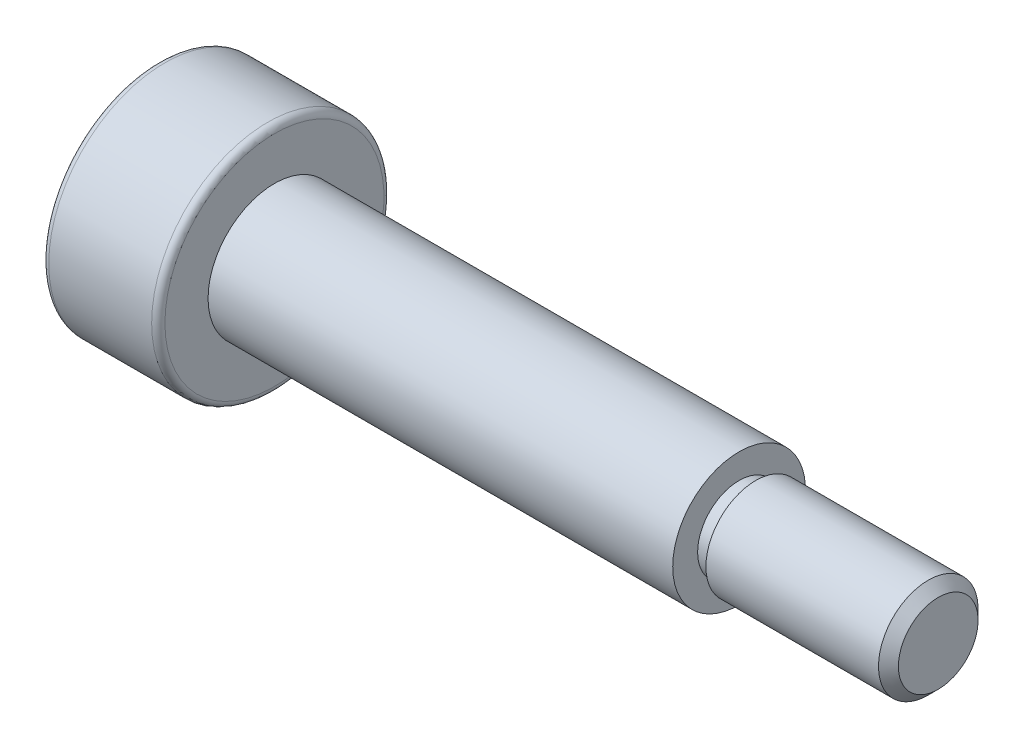
ISO-10303-21;
HEADER;
FILE_DESCRIPTION(('STEP AP214'),'2;1');
FILE_NAME('part.step','',(''),(''),'','','');
FILE_SCHEMA(('AUTOMOTIVE_DESIGN { 1 0 10303 214 1 1 1 1 }'));
ENDSEC;
DATA;
#1=APPLICATION_CONTEXT('core data for automotive mechanical design processes');
#2=APPLICATION_PROTOCOL_DEFINITION('international standard','automotive_design',2000,#1);
#3=PRODUCT_CONTEXT('',#1,'mechanical');
#4=PRODUCT('Part','Part','',(#3));
#5=PRODUCT_RELATED_PRODUCT_CATEGORY('part','',(#4));
#6=PRODUCT_DEFINITION_FORMATION('','',#4);
#7=PRODUCT_DEFINITION_CONTEXT('part definition',#1,'design');
#8=PRODUCT_DEFINITION('design','',#6,#7);
#9=PRODUCT_DEFINITION_SHAPE('','',#8);
#10=(LENGTH_UNIT() NAMED_UNIT(*) SI_UNIT(.MILLI.,.METRE.));
#11=(NAMED_UNIT(*) PLANE_ANGLE_UNIT() SI_UNIT($,.RADIAN.));
#12=(NAMED_UNIT(*) SI_UNIT($,.STERADIAN.) SOLID_ANGLE_UNIT());
#13=UNCERTAINTY_MEASURE_WITH_UNIT(LENGTH_MEASURE(1.E-05),#10,'distance_accuracy_value','');
#14=(GEOMETRIC_REPRESENTATION_CONTEXT(3) GLOBAL_UNCERTAINTY_ASSIGNED_CONTEXT((#13)) GLOBAL_UNIT_ASSIGNED_CONTEXT((#10,
#11,#12)) REPRESENTATION_CONTEXT('',''));
#15=CARTESIAN_POINT('',(0.,0.,0.));
#16=DIRECTION('',(0.,0.,1.));
#17=DIRECTION('',(1.,0.,0.));
#18=AXIS2_PLACEMENT_3D('',#15,#16,#17);
#19=CARTESIAN_POINT('',(-11.75,0.,0.));
#20=DIRECTION('',(1.,0.,0.));
#21=DIRECTION('',(0.,0.,-1.));
#22=AXIS2_PLACEMENT_3D('',#19,#20,#21);
#23=PLANE('',#22);
#24=DIRECTION('',(0.,0.866025403784438,-0.5));
#25=VECTOR('',#24,1.);
#26=CARTESIAN_POINT('',(-11.75,0.,1.73205080756888));
#27=LINE('',#26,#25);
#28=CARTESIAN_POINT('',(-11.75,0.,1.73205080756888));
#29=VERTEX_POINT('',#28);
#30=CARTESIAN_POINT('',(-11.75,1.5,0.866025403784438));
#31=VERTEX_POINT('',#30);
#32=EDGE_CURVE('E125',#29,#31,#27,.T.);
#33=ORIENTED_EDGE('',*,*,#32,.F.);
#34=DIRECTION('',(0.,0.866025403784439,0.5));
#35=VECTOR('',#34,1.);
#36=CARTESIAN_POINT('',(-11.75,-1.5,0.866025403784438));
#37=LINE('',#36,#35);
#38=CARTESIAN_POINT('',(-11.75,-1.5,0.866025403784438));
#39=VERTEX_POINT('',#38);
#40=EDGE_CURVE('E51',#39,#29,#37,.T.);
#41=ORIENTED_EDGE('',*,*,#40,.F.);
#42=DIRECTION('',(0.,0.,1.));
#43=VECTOR('',#42,1.);
#44=CARTESIAN_POINT('',(-11.75,-1.5,-0.866025403784438));
#45=LINE('',#44,#43);
#46=CARTESIAN_POINT('',(-11.75,-1.5,-0.866025403784438));
#47=VERTEX_POINT('',#46);
#48=EDGE_CURVE('E134',#47,#39,#45,.T.);
#49=ORIENTED_EDGE('',*,*,#48,.F.);
#50=DIRECTION('',(0.,-0.866025403784438,0.5));
#51=VECTOR('',#50,1.);
#52=CARTESIAN_POINT('',(-11.75,0.,-1.73205080756888));
#53=LINE('',#52,#51);
#54=CARTESIAN_POINT('',(-11.75,0.,-1.73205080756888));
#55=VERTEX_POINT('',#54);
#56=EDGE_CURVE('E132',#55,#47,#53,.T.);
#57=ORIENTED_EDGE('',*,*,#56,.F.);
#58=DIRECTION('',(0.,-0.866025403784439,-0.5));
#59=VECTOR('',#58,1.);
#60=CARTESIAN_POINT('',(-11.75,1.5,-0.866025403784438));
#61=LINE('',#60,#59);
#62=CARTESIAN_POINT('',(-11.75,1.5,-0.866025403784438));
#63=VERTEX_POINT('',#62);
#64=EDGE_CURVE('E99',#63,#55,#61,.T.);
#65=ORIENTED_EDGE('',*,*,#64,.F.);
#66=DIRECTION('',(0.,0.,-1.));
#67=VECTOR('',#66,1.);
#68=CARTESIAN_POINT('',(-11.75,1.5,0.866025403784438));
#69=LINE('',#68,#67);
#70=EDGE_CURVE('E128',#31,#63,#69,.T.);
#71=ORIENTED_EDGE('',*,*,#70,.F.);
#72=EDGE_LOOP('',(#33,#41,#49,#57,#65,#71));
#73=FACE_BOUND('',#72,.T.);
#74=CARTESIAN_POINT('',(-11.75,0.,0.));
#75=DIRECTION('',(1.,0.,0.));
#76=DIRECTION('',(0.,0.,-1.));
#77=AXIS2_PLACEMENT_3D('',#74,#75,#76);
#78=CIRCLE('',#77,3.3);
#79=CARTESIAN_POINT('',(-11.75,0.,-3.3));
#80=VERTEX_POINT('',#79);
#81=EDGE_CURVE('E167',#80,#80,#78,.F.);
#82=ORIENTED_EDGE('',*,*,#81,.T.);
#83=EDGE_LOOP('',(#82));
#84=FACE_BOUND('',#83,.T.);
#85=ADVANCED_FACE('F35',(#73,#84),#23,.F.);
#86=CARTESIAN_POINT('',(-11.75,0.,0.));
#87=DIRECTION('',(-1.,0.,0.));
#88=DIRECTION('',(0.,0.,1.));
#89=AXIS2_PLACEMENT_3D('',#86,#87,#88);
#90=CYLINDRICAL_SURFACE('',#89,3.5);
#91=CARTESIAN_POINT('',(-8.45,0.,0.));
#92=DIRECTION('',(-1.,0.,0.));
#93=DIRECTION('',(0.,0.,1.));
#94=AXIS2_PLACEMENT_3D('',#91,#92,#93);
#95=CIRCLE('',#94,3.5);
#96=CARTESIAN_POINT('',(-8.45,0.,3.5));
#97=VERTEX_POINT('',#96);
#98=EDGE_CURVE('E161',#97,#97,#95,.T.);
#99=ORIENTED_EDGE('',*,*,#98,.T.);
#100=EDGE_LOOP('',(#99));
#101=FACE_BOUND('',#100,.T.);
#102=CARTESIAN_POINT('',(-11.55,0.,0.));
#103=DIRECTION('',(1.,0.,0.));
#104=DIRECTION('',(0.,0.,-1.));
#105=AXIS2_PLACEMENT_3D('',#102,#103,#104);
#106=CIRCLE('',#105,3.5);
#107=CARTESIAN_POINT('',(-11.55,0.,-3.5));
#108=VERTEX_POINT('',#107);
#109=EDGE_CURVE('E158',#108,#108,#106,.T.);
#110=ORIENTED_EDGE('',*,*,#109,.T.);
#111=EDGE_LOOP('',(#110));
#112=FACE_BOUND('',#111,.T.);
#113=ADVANCED_FACE('F189',(#101,#112),#90,.T.);
#114=CARTESIAN_POINT('',(-8.25,3.5,0.));
#115=DIRECTION('',(-1.,0.,0.));
#116=DIRECTION('',(0.,0.,1.));
#117=AXIS2_PLACEMENT_3D('',#114,#115,#116);
#118=PLANE('',#117);
#119=CARTESIAN_POINT('',(-8.25,0.,0.));
#120=DIRECTION('',(-1.,0.,0.));
#121=DIRECTION('',(0.,0.,1.));
#122=AXIS2_PLACEMENT_3D('',#119,#120,#121);
#123=CIRCLE('',#122,3.3);
#124=CARTESIAN_POINT('',(-8.25,0.,3.3));
#125=VERTEX_POINT('',#124);
#126=EDGE_CURVE('E164',#125,#125,#123,.F.);
#127=ORIENTED_EDGE('',*,*,#126,.T.);
#128=EDGE_LOOP('',(#127));
#129=FACE_BOUND('',#128,.T.);
#130=CARTESIAN_POINT('',(-8.25,0.,0.));
#131=DIRECTION('',(-1.,0.,0.));
#132=DIRECTION('',(0.,0.,1.));
#133=AXIS2_PLACEMENT_3D('',#130,#131,#132);
#134=CIRCLE('',#133,2.);
#135=CARTESIAN_POINT('',(-8.25,0.,2.));
#136=VERTEX_POINT('',#135);
#137=EDGE_CURVE('E155',#136,#136,#134,.T.);
#138=ORIENTED_EDGE('',*,*,#137,.T.);
#139=EDGE_LOOP('',(#138));
#140=FACE_BOUND('',#139,.T.);
#141=ADVANCED_FACE('F195',(#129,#140),#118,.F.);
#142=CARTESIAN_POINT('',(-11.75,0.,0.));
#143=DIRECTION('',(-1.,0.,0.));
#144=DIRECTION('',(0.,0.,1.));
#145=AXIS2_PLACEMENT_3D('',#142,#143,#144);
#146=CYLINDRICAL_SURFACE('',#145,2.);
#147=ORIENTED_EDGE('',*,*,#137,.F.);
#148=EDGE_LOOP('',(#147));
#149=FACE_BOUND('',#148,.T.);
#150=CARTESIAN_POINT('',(5.75,0.,0.));
#151=DIRECTION('',(-1.,0.,0.));
#152=DIRECTION('',(0.,0.,1.));
#153=AXIS2_PLACEMENT_3D('',#150,#151,#152);
#154=CIRCLE('',#153,2.);
#155=CARTESIAN_POINT('',(5.75,0.,2.));
#156=VERTEX_POINT('',#155);
#157=EDGE_CURVE('E152',#156,#156,#154,.T.);
#158=ORIENTED_EDGE('',*,*,#157,.T.);
#159=EDGE_LOOP('',(#158));
#160=FACE_BOUND('',#159,.T.);
#161=ADVANCED_FACE('F229',(#149,#160),#146,.T.);
#162=CARTESIAN_POINT('',(5.75,2.,0.));
#163=DIRECTION('',(-1.,0.,0.));
#164=DIRECTION('',(0.,0.,1.));
#165=AXIS2_PLACEMENT_3D('',#162,#163,#164);
#166=PLANE('',#165);
#167=ORIENTED_EDGE('',*,*,#157,.F.);
#168=EDGE_LOOP('',(#167));
#169=FACE_BOUND('',#168,.T.);
#170=CARTESIAN_POINT('',(5.75,0.,0.));
#171=DIRECTION('',(-1.,0.,0.));
#172=DIRECTION('',(0.,0.,1.));
#173=AXIS2_PLACEMENT_3D('',#170,#171,#172);
#174=CIRCLE('',#173,1.25);
#175=CARTESIAN_POINT('',(5.75,0.,1.25));
#176=VERTEX_POINT('',#175);
#177=EDGE_CURVE('E149',#176,#176,#174,.T.);
#178=ORIENTED_EDGE('',*,*,#177,.T.);
#179=EDGE_LOOP('',(#178));
#180=FACE_BOUND('',#179,.T.);
#181=ADVANCED_FACE('F205',(#169,#180),#166,.F.);
#182=CARTESIAN_POINT('',(-8.45,0.,0.));
#183=DIRECTION('',(-1.,0.,0.));
#184=DIRECTION('',(0.,0.,1.));
#185=AXIS2_PLACEMENT_3D('',#182,#183,#184);
#186=TOROIDAL_SURFACE('',#185,3.3,0.2);
#187=ORIENTED_EDGE('',*,*,#126,.F.);
#188=EDGE_LOOP('',(#187));
#189=FACE_BOUND('',#188,.T.);
#190=ORIENTED_EDGE('',*,*,#98,.F.);
#191=EDGE_LOOP('',(#190));
#192=FACE_BOUND('',#191,.T.);
#193=ADVANCED_FACE('F202',(#189,#192),#186,.T.);
#194=CARTESIAN_POINT('',(-11.55,0.,0.));
#195=DIRECTION('',(1.,0.,0.));
#196=DIRECTION('',(0.,0.,-1.));
#197=AXIS2_PLACEMENT_3D('',#194,#195,#196);
#198=TOROIDAL_SURFACE('',#197,3.3,0.2);
#199=ORIENTED_EDGE('',*,*,#109,.F.);
#200=EDGE_LOOP('',(#199));
#201=FACE_BOUND('',#200,.T.);
#202=ORIENTED_EDGE('',*,*,#81,.F.);
#203=EDGE_LOOP('',(#202));
#204=FACE_BOUND('',#203,.T.);
#205=ADVANCED_FACE('F204',(#201,#204),#198,.T.);
#206=CARTESIAN_POINT('',(5.75,0.,0.));
#207=DIRECTION('',(-1.,0.,0.));
#208=DIRECTION('',(0.,0.,1.));
#209=AXIS2_PLACEMENT_3D('',#206,#207,#208);
#210=CYLINDRICAL_SURFACE('',#209,1.25);
#211=CARTESIAN_POINT('',(6.25,0.,0.));
#212=DIRECTION('',(-1.,0.,0.));
#213=DIRECTION('',(0.,0.,1.));
#214=AXIS2_PLACEMENT_3D('',#211,#212,#213);
#215=CIRCLE('',#214,1.25);
#216=CARTESIAN_POINT('',(6.25,0.,1.25));
#217=VERTEX_POINT('',#216);
#218=EDGE_CURVE('E146',#217,#217,#215,.T.);
#219=ORIENTED_EDGE('',*,*,#218,.T.);
#220=EDGE_LOOP('',(#219));
#221=FACE_BOUND('',#220,.T.);
#222=ORIENTED_EDGE('',*,*,#177,.F.);
#223=EDGE_LOOP('',(#222));
#224=FACE_BOUND('',#223,.T.);
#225=ADVANCED_FACE('F208',(#221,#224),#210,.T.);
#226=CARTESIAN_POINT('',(6.25,1.5,0.));
#227=DIRECTION('',(-1.,0.,0.));
#228=DIRECTION('',(0.,0.,1.));
#229=AXIS2_PLACEMENT_3D('',#226,#227,#228);
#230=PLANE('',#229);
#231=CARTESIAN_POINT('',(6.25,0.,0.));
#232=DIRECTION('',(-1.,0.,0.));
#233=DIRECTION('',(0.,0.,1.));
#234=AXIS2_PLACEMENT_3D('',#231,#232,#233);
#235=CIRCLE('',#234,1.5);
#236=CARTESIAN_POINT('',(6.25,0.,1.5));
#237=VERTEX_POINT('',#236);
#238=EDGE_CURVE('E138',#237,#237,#235,.T.);
#239=ORIENTED_EDGE('',*,*,#238,.T.);
#240=EDGE_LOOP('',(#239));
#241=FACE_BOUND('',#240,.T.);
#242=ORIENTED_EDGE('',*,*,#218,.F.);
#243=EDGE_LOOP('',(#242));
#244=FACE_BOUND('',#243,.T.);
#245=ADVANCED_FACE('F184',(#241,#244),#230,.T.);
#246=CARTESIAN_POINT('',(11.75,1.5,0.));
#247=DIRECTION('',(-1.,0.,0.));
#248=DIRECTION('',(0.,0.,1.));
#249=AXIS2_PLACEMENT_3D('',#246,#247,#248);
#250=PLANE('',#249);
#251=CARTESIAN_POINT('',(11.75,0.,0.));
#252=DIRECTION('',(-1.,0.,0.));
#253=DIRECTION('',(0.,0.,1.));
#254=AXIS2_PLACEMENT_3D('',#251,#252,#253);
#255=CIRCLE('',#254,1.2);
#256=CARTESIAN_POINT('',(11.75,0.,1.2));
#257=VERTEX_POINT('',#256);
#258=EDGE_CURVE('E11',#257,#257,#255,.F.);
#259=ORIENTED_EDGE('',*,*,#258,.T.);
#260=EDGE_LOOP('',(#259));
#261=FACE_BOUND('',#260,.T.);
#262=ADVANCED_FACE('F176',(#261),#250,.F.);
#263=CARTESIAN_POINT('',(11.45,0.,0.));
#264=DIRECTION('',(-1.,0.,0.));
#265=DIRECTION('',(0.,0.,1.));
#266=AXIS2_PLACEMENT_3D('',#263,#264,#265);
#267=CONICAL_SURFACE('',#266,1.5,0.785398163397446);
#268=ORIENTED_EDGE('',*,*,#258,.F.);
#269=EDGE_LOOP('',(#268));
#270=FACE_BOUND('',#269,.T.);
#271=CARTESIAN_POINT('',(11.45,0.,0.));
#272=DIRECTION('',(-1.,0.,0.));
#273=DIRECTION('',(0.,0.,1.));
#274=AXIS2_PLACEMENT_3D('',#271,#272,#273);
#275=CIRCLE('',#274,1.5);
#276=CARTESIAN_POINT('',(11.45,0.,1.5));
#277=VERTEX_POINT('',#276);
#278=EDGE_CURVE('E44',#277,#277,#275,.T.);
#279=ORIENTED_EDGE('',*,*,#278,.F.);
#280=EDGE_LOOP('',(#279));
#281=FACE_BOUND('',#280,.T.);
#282=ADVANCED_FACE('F38',(#270,#281),#267,.T.);
#283=CARTESIAN_POINT('',(-11.75,0.,0.));
#284=DIRECTION('',(-1.,0.,0.));
#285=DIRECTION('',(0.,0.,1.));
#286=AXIS2_PLACEMENT_3D('',#283,#284,#285);
#287=CYLINDRICAL_SURFACE('',#286,1.5);
#288=ORIENTED_EDGE('',*,*,#278,.T.);
#289=EDGE_LOOP('',(#288));
#290=FACE_BOUND('',#289,.T.);
#291=ORIENTED_EDGE('',*,*,#238,.F.);
#292=EDGE_LOOP('',(#291));
#293=FACE_BOUND('',#292,.T.);
#294=ADVANCED_FACE('F172',(#290,#293),#287,.T.);
#295=CARTESIAN_POINT('',(-9.75,-1.5,0.866025403784438));
#296=DIRECTION('',(0.,-0.5,0.866025403784439));
#297=DIRECTION('',(0.,-0.866025403784439,-0.5));
#298=AXIS2_PLACEMENT_3D('',#295,#296,#297);
#299=PLANE('',#298);
#300=ORIENTED_EDGE('',*,*,#40,.T.);
#301=DIRECTION('',(-1.,0.,0.));
#302=VECTOR('',#301,1.);
#303=CARTESIAN_POINT('',(-9.75,0.,1.73205080756888));
#304=LINE('',#303,#302);
#305=CARTESIAN_POINT('',(-9.75,0.,1.73205080756888));
#306=VERTEX_POINT('',#305);
#307=EDGE_CURVE('E81',#306,#29,#304,.T.);
#308=ORIENTED_EDGE('',*,*,#307,.F.);
#309=DIRECTION('',(0.,0.866025403784439,0.5));
#310=VECTOR('',#309,1.);
#311=CARTESIAN_POINT('',(-9.75,-1.5,0.866025403784438));
#312=LINE('',#311,#310);
#313=CARTESIAN_POINT('',(-9.75,-1.5,0.866025403784438));
#314=VERTEX_POINT('',#313);
#315=EDGE_CURVE('E136',#314,#306,#312,.T.);
#316=ORIENTED_EDGE('',*,*,#315,.F.);
#317=DIRECTION('',(-1.,0.,0.));
#318=VECTOR('',#317,1.);
#319=CARTESIAN_POINT('',(-9.75,-1.5,0.866025403784438));
#320=LINE('',#319,#318);
#321=EDGE_CURVE('E59',#314,#39,#320,.T.);
#322=ORIENTED_EDGE('',*,*,#321,.T.);
#323=EDGE_LOOP('',(#300,#308,#316,#322));
#324=FACE_BOUND('',#323,.T.);
#325=ADVANCED_FACE('F182',(#324),#299,.F.);
#326=CARTESIAN_POINT('',(-9.75,-1.5,-0.866025403784438));
#327=DIRECTION('',(0.,-1.,0.));
#328=DIRECTION('',(0.,0.,-1.));
#329=AXIS2_PLACEMENT_3D('',#326,#327,#328);
#330=PLANE('',#329);
#331=ORIENTED_EDGE('',*,*,#48,.T.);
#332=ORIENTED_EDGE('',*,*,#321,.F.);
#333=DIRECTION('',(0.,0.,1.));
#334=VECTOR('',#333,1.);
#335=CARTESIAN_POINT('',(-9.75,-1.5,-0.866025403784438));
#336=LINE('',#335,#334);
#337=CARTESIAN_POINT('',(-9.75,-1.5,-0.866025403784438));
#338=VERTEX_POINT('',#337);
#339=EDGE_CURVE('E111',#338,#314,#336,.T.);
#340=ORIENTED_EDGE('',*,*,#339,.F.);
#341=DIRECTION('',(-1.,0.,0.));
#342=VECTOR('',#341,1.);
#343=CARTESIAN_POINT('',(-9.75,-1.5,-0.866025403784438));
#344=LINE('',#343,#342);
#345=EDGE_CURVE('E103',#338,#47,#344,.T.);
#346=ORIENTED_EDGE('',*,*,#345,.T.);
#347=EDGE_LOOP('',(#331,#332,#340,#346));
#348=FACE_BOUND('',#347,.T.);
#349=ADVANCED_FACE('F303',(#348),#330,.F.);
#350=CARTESIAN_POINT('',(-9.75,0.,-1.73205080756888));
#351=DIRECTION('',(0.,-0.5,-0.866025403784438));
#352=DIRECTION('',(0.,0.866025403784439,-0.5));
#353=AXIS2_PLACEMENT_3D('',#350,#351,#352);
#354=PLANE('',#353);
#355=ORIENTED_EDGE('',*,*,#56,.T.);
#356=ORIENTED_EDGE('',*,*,#345,.F.);
#357=DIRECTION('',(0.,-0.866025403784438,0.5));
#358=VECTOR('',#357,1.);
#359=CARTESIAN_POINT('',(-9.75,0.,-1.73205080756888));
#360=LINE('',#359,#358);
#361=CARTESIAN_POINT('',(-9.75,0.,-1.73205080756888));
#362=VERTEX_POINT('',#361);
#363=EDGE_CURVE('E107',#362,#338,#360,.T.);
#364=ORIENTED_EDGE('',*,*,#363,.F.);
#365=DIRECTION('',(-1.,0.,0.));
#366=VECTOR('',#365,1.);
#367=CARTESIAN_POINT('',(-9.75,0.,-1.73205080756888));
#368=LINE('',#367,#366);
#369=EDGE_CURVE('E92',#362,#55,#368,.T.);
#370=ORIENTED_EDGE('',*,*,#369,.T.);
#371=EDGE_LOOP('',(#355,#356,#364,#370));
#372=FACE_BOUND('',#371,.T.);
#373=ADVANCED_FACE('F108',(#372),#354,.F.);
#374=CARTESIAN_POINT('',(-9.75,1.5,-0.866025403784438));
#375=DIRECTION('',(0.,0.5,-0.866025403784439));
#376=DIRECTION('',(0.,0.866025403784439,0.5));
#377=AXIS2_PLACEMENT_3D('',#374,#375,#376);
#378=PLANE('',#377);
#379=ORIENTED_EDGE('',*,*,#64,.T.);
#380=ORIENTED_EDGE('',*,*,#369,.F.);
#381=DIRECTION('',(0.,-0.866025403784439,-0.5));
#382=VECTOR('',#381,1.);
#383=CARTESIAN_POINT('',(-9.75,1.5,-0.866025403784438));
#384=LINE('',#383,#382);
#385=CARTESIAN_POINT('',(-9.75,1.5,-0.866025403784438));
#386=VERTEX_POINT('',#385);
#387=EDGE_CURVE('E96',#386,#362,#384,.T.);
#388=ORIENTED_EDGE('',*,*,#387,.F.);
#389=DIRECTION('',(-1.,0.,0.));
#390=VECTOR('',#389,1.);
#391=CARTESIAN_POINT('',(-9.75,1.5,-0.866025403784438));
#392=LINE('',#391,#390);
#393=EDGE_CURVE('E104',#386,#63,#392,.T.);
#394=ORIENTED_EDGE('',*,*,#393,.T.);
#395=EDGE_LOOP('',(#379,#380,#388,#394));
#396=FACE_BOUND('',#395,.T.);
#397=ADVANCED_FACE('F94',(#396),#378,.F.);
#398=CARTESIAN_POINT('',(-9.75,1.5,0.866025403784438));
#399=DIRECTION('',(0.,1.,0.));
#400=DIRECTION('',(0.,0.,1.));
#401=AXIS2_PLACEMENT_3D('',#398,#399,#400);
#402=PLANE('',#401);
#403=ORIENTED_EDGE('',*,*,#70,.T.);
#404=ORIENTED_EDGE('',*,*,#393,.F.);
#405=DIRECTION('',(0.,0.,-1.));
#406=VECTOR('',#405,1.);
#407=CARTESIAN_POINT('',(-9.75,1.5,0.866025403784438));
#408=LINE('',#407,#406);
#409=CARTESIAN_POINT('',(-9.75,1.5,0.866025403784438));
#410=VERTEX_POINT('',#409);
#411=EDGE_CURVE('E117',#410,#386,#408,.T.);
#412=ORIENTED_EDGE('',*,*,#411,.F.);
#413=DIRECTION('',(-1.,0.,0.));
#414=VECTOR('',#413,1.);
#415=CARTESIAN_POINT('',(-9.75,1.5,0.866025403784438));
#416=LINE('',#415,#414);
#417=EDGE_CURVE('E141',#410,#31,#416,.T.);
#418=ORIENTED_EDGE('',*,*,#417,.T.);
#419=EDGE_LOOP('',(#403,#404,#412,#418));
#420=FACE_BOUND('',#419,.T.);
#421=ADVANCED_FACE('F324',(#420),#402,.F.);
#422=CARTESIAN_POINT('',(-9.75,0.,1.73205080756888));
#423=DIRECTION('',(0.,0.5,0.866025403784438));
#424=DIRECTION('',(0.,-0.866025403784439,0.5));
#425=AXIS2_PLACEMENT_3D('',#422,#423,#424);
#426=PLANE('',#425);
#427=ORIENTED_EDGE('',*,*,#32,.T.);
#428=ORIENTED_EDGE('',*,*,#417,.F.);
#429=DIRECTION('',(0.,0.866025403784438,-0.5));
#430=VECTOR('',#429,1.);
#431=CARTESIAN_POINT('',(-9.75,0.,1.73205080756888));
#432=LINE('',#431,#430);
#433=EDGE_CURVE('E119',#306,#410,#432,.T.);
#434=ORIENTED_EDGE('',*,*,#433,.F.);
#435=ORIENTED_EDGE('',*,*,#307,.T.);
#436=EDGE_LOOP('',(#427,#428,#434,#435));
#437=FACE_BOUND('',#436,.T.);
#438=ADVANCED_FACE('F332',(#437),#426,.F.);
#439=CARTESIAN_POINT('',(-9.75,0.,0.));
#440=DIRECTION('',(-1.,0.,0.));
#441=DIRECTION('',(0.,0.,1.));
#442=AXIS2_PLACEMENT_3D('',#439,#440,#441);
#443=PLANE('',#442);
#444=ORIENTED_EDGE('',*,*,#315,.T.);
#445=ORIENTED_EDGE('',*,*,#433,.T.);
#446=ORIENTED_EDGE('',*,*,#411,.T.);
#447=ORIENTED_EDGE('',*,*,#387,.T.);
#448=ORIENTED_EDGE('',*,*,#363,.T.);
#449=ORIENTED_EDGE('',*,*,#339,.T.);
#450=EDGE_LOOP('',(#444,#445,#446,#447,#448,#449));
#451=FACE_BOUND('',#450,.T.);
#452=ADVANCED_FACE('F114',(#451),#443,.T.);
#453=CLOSED_SHELL('',(#85,#113,#141,#161,#181,#193,#205,#225,#245,#262,#282,#294,#325,#349,#373,
#397,#421,#438,#452));
#454=MANIFOLD_SOLID_BREP('B2',#453);
#455=ADVANCED_BREP_SHAPE_REPRESENTATION('',(#18,#454),#14);
#456=SHAPE_DEFINITION_REPRESENTATION(#9,#455);
ENDSEC;
END-ISO-10303-21;
